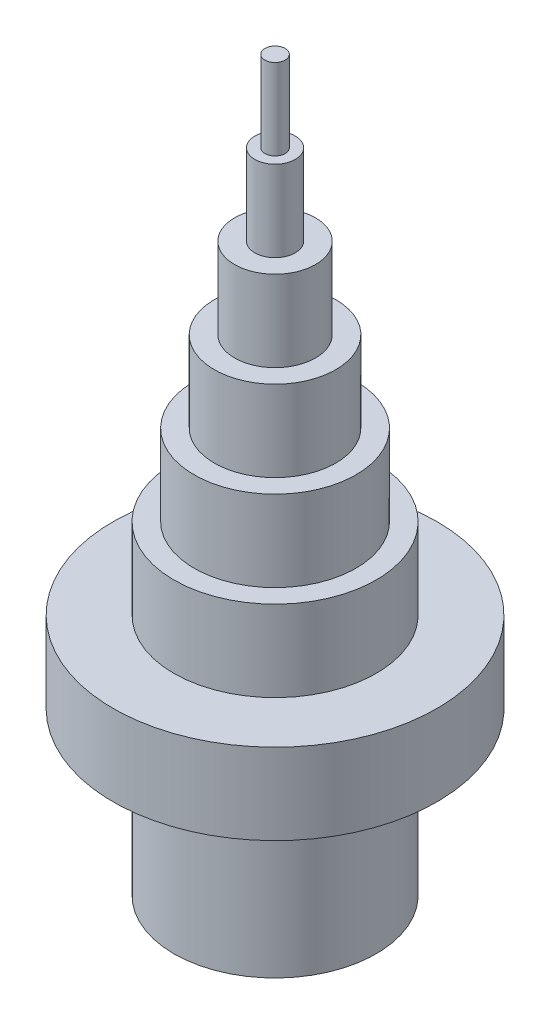
ISO-10303-21;
HEADER;
FILE_DESCRIPTION(('STEP AP214'),'2;1');
FILE_NAME('part.step','',(''),(''),'','','');
FILE_SCHEMA(('AUTOMOTIVE_DESIGN { 1 0 10303 214 1 1 1 1 }'));
ENDSEC;
DATA;
#1=APPLICATION_CONTEXT('core data for automotive mechanical design processes');
#2=APPLICATION_PROTOCOL_DEFINITION('international standard','automotive_design',2000,#1);
#3=PRODUCT_CONTEXT('',#1,'mechanical');
#4=PRODUCT('Part','Part','',(#3));
#5=PRODUCT_RELATED_PRODUCT_CATEGORY('part','',(#4));
#6=PRODUCT_DEFINITION_FORMATION('','',#4);
#7=PRODUCT_DEFINITION_CONTEXT('part definition',#1,'design');
#8=PRODUCT_DEFINITION('design','',#6,#7);
#9=PRODUCT_DEFINITION_SHAPE('','',#8);
#10=(LENGTH_UNIT() NAMED_UNIT(*) SI_UNIT(.MILLI.,.METRE.));
#11=(NAMED_UNIT(*) PLANE_ANGLE_UNIT() SI_UNIT($,.RADIAN.));
#12=(NAMED_UNIT(*) SI_UNIT($,.STERADIAN.) SOLID_ANGLE_UNIT());
#13=UNCERTAINTY_MEASURE_WITH_UNIT(LENGTH_MEASURE(1.E-05),#10,'distance_accuracy_value','');
#14=(GEOMETRIC_REPRESENTATION_CONTEXT(3) GLOBAL_UNCERTAINTY_ASSIGNED_CONTEXT((#13)) GLOBAL_UNIT_ASSIGNED_CONTEXT((#10,
#11,#12)) REPRESENTATION_CONTEXT('',''));
#15=CARTESIAN_POINT('',(0.,0.,0.));
#16=DIRECTION('',(0.,0.,1.));
#17=DIRECTION('',(1.,0.,0.));
#18=AXIS2_PLACEMENT_3D('',#15,#16,#17);
#19=CARTESIAN_POINT('',(0.,0.,0.));
#20=DIRECTION('',(0.,-1.,0.));
#21=DIRECTION('',(0.,0.,-1.));
#22=AXIS2_PLACEMENT_3D('',#19,#20,#21);
#23=PLANE('',#22);
#24=CARTESIAN_POINT('',(0.,0.,0.));
#25=DIRECTION('',(0.,-1.,0.));
#26=DIRECTION('',(0.,0.,-1.));
#27=AXIS2_PLACEMENT_3D('',#24,#25,#26);
#28=CIRCLE('',#27,20.);
#29=CARTESIAN_POINT('',(0.,0.,-20.));
#30=VERTEX_POINT('',#29);
#31=EDGE_CURVE('E87',#30,#30,#28,.T.);
#32=ORIENTED_EDGE('',*,*,#31,.F.);
#33=EDGE_LOOP('',(#32));
#34=FACE_BOUND('',#33,.T.);
#35=CARTESIAN_POINT('',(0.,0.,0.));
#36=DIRECTION('',(0.,-1.,0.));
#37=DIRECTION('',(0.,0.,-1.));
#38=AXIS2_PLACEMENT_3D('',#35,#36,#37);
#39=CIRCLE('',#38,25.);
#40=CARTESIAN_POINT('',(0.,0.,-25.));
#41=VERTEX_POINT('',#40);
#42=EDGE_CURVE('E10',#41,#41,#39,.T.);
#43=ORIENTED_EDGE('',*,*,#42,.T.);
#44=EDGE_LOOP('',(#43));
#45=FACE_BOUND('',#44,.T.);
#46=ADVANCED_FACE('F31',(#34,#45),#23,.T.);
#47=CARTESIAN_POINT('',(0.,0.,0.));
#48=DIRECTION('',(0.,-1.,0.));
#49=DIRECTION('',(0.,0.,-1.));
#50=AXIS2_PLACEMENT_3D('',#47,#48,#49);
#51=CYLINDRICAL_SURFACE('',#50,25.);
#52=CARTESIAN_POINT('',(0.,40.,0.));
#53=DIRECTION('',(0.,-1.,0.));
#54=DIRECTION('',(0.,0.,-1.));
#55=AXIS2_PLACEMENT_3D('',#52,#53,#54);
#56=CIRCLE('',#55,25.);
#57=CARTESIAN_POINT('',(0.,40.,-25.));
#58=VERTEX_POINT('',#57);
#59=EDGE_CURVE('E37',#58,#58,#56,.T.);
#60=ORIENTED_EDGE('',*,*,#59,.T.);
#61=EDGE_LOOP('',(#60));
#62=FACE_BOUND('',#61,.T.);
#63=ORIENTED_EDGE('',*,*,#42,.F.);
#64=EDGE_LOOP('',(#63));
#65=FACE_BOUND('',#64,.T.);
#66=ADVANCED_FACE('F103',(#62,#65),#51,.T.);
#67=CARTESIAN_POINT('',(25.,40.,0.));
#68=DIRECTION('',(0.,-1.,0.));
#69=DIRECTION('',(0.,0.,-1.));
#70=AXIS2_PLACEMENT_3D('',#67,#68,#69);
#71=PLANE('',#70);
#72=CARTESIAN_POINT('',(0.,40.,0.));
#73=DIRECTION('',(0.,-1.,0.));
#74=DIRECTION('',(0.,0.,-1.));
#75=AXIS2_PLACEMENT_3D('',#72,#73,#74);
#76=CIRCLE('',#75,40.);
#77=CARTESIAN_POINT('',(0.,40.,-40.));
#78=VERTEX_POINT('',#77);
#79=EDGE_CURVE('E41',#78,#78,#76,.T.);
#80=ORIENTED_EDGE('',*,*,#79,.T.);
#81=EDGE_LOOP('',(#80));
#82=FACE_BOUND('',#81,.T.);
#83=ORIENTED_EDGE('',*,*,#59,.F.);
#84=EDGE_LOOP('',(#83));
#85=FACE_BOUND('',#84,.T.);
#86=ADVANCED_FACE('F107',(#82,#85),#71,.T.);
#87=CARTESIAN_POINT('',(0.,0.,0.));
#88=DIRECTION('',(0.,-1.,0.));
#89=DIRECTION('',(0.,0.,-1.));
#90=AXIS2_PLACEMENT_3D('',#87,#88,#89);
#91=CYLINDRICAL_SURFACE('',#90,40.);
#92=CARTESIAN_POINT('',(0.,60.,0.));
#93=DIRECTION('',(0.,-1.,0.));
#94=DIRECTION('',(0.,0.,-1.));
#95=AXIS2_PLACEMENT_3D('',#92,#93,#94);
#96=CIRCLE('',#95,40.);
#97=CARTESIAN_POINT('',(0.,60.,-40.));
#98=VERTEX_POINT('',#97);
#99=EDGE_CURVE('E45',#98,#98,#96,.T.);
#100=ORIENTED_EDGE('',*,*,#99,.T.);
#101=EDGE_LOOP('',(#100));
#102=FACE_BOUND('',#101,.T.);
#103=ORIENTED_EDGE('',*,*,#79,.F.);
#104=EDGE_LOOP('',(#103));
#105=FACE_BOUND('',#104,.T.);
#106=ADVANCED_FACE('F111',(#102,#105),#91,.T.);
#107=CARTESIAN_POINT('',(40.,60.,0.));
#108=DIRECTION('',(0.,1.,0.));
#109=DIRECTION('',(0.,0.,1.));
#110=AXIS2_PLACEMENT_3D('',#107,#108,#109);
#111=PLANE('',#110);
#112=CARTESIAN_POINT('',(0.,60.,0.));
#113=DIRECTION('',(0.,-1.,0.));
#114=DIRECTION('',(0.,0.,-1.));
#115=AXIS2_PLACEMENT_3D('',#112,#113,#114);
#116=CIRCLE('',#115,25.);
#117=CARTESIAN_POINT('',(0.,60.,-25.));
#118=VERTEX_POINT('',#117);
#119=EDGE_CURVE('E50',#118,#118,#116,.T.);
#120=ORIENTED_EDGE('',*,*,#119,.T.);
#121=EDGE_LOOP('',(#120));
#122=FACE_BOUND('',#121,.T.);
#123=ORIENTED_EDGE('',*,*,#99,.F.);
#124=EDGE_LOOP('',(#123));
#125=FACE_BOUND('',#124,.T.);
#126=ADVANCED_FACE('F118',(#122,#125),#111,.T.);
#127=CARTESIAN_POINT('',(0.,0.,0.));
#128=DIRECTION('',(0.,-1.,0.));
#129=DIRECTION('',(0.,0.,-1.));
#130=AXIS2_PLACEMENT_3D('',#127,#128,#129);
#131=CYLINDRICAL_SURFACE('',#130,25.);
#132=CARTESIAN_POINT('',(0.,80.,0.));
#133=DIRECTION('',(0.,-1.,0.));
#134=DIRECTION('',(0.,0.,-1.));
#135=AXIS2_PLACEMENT_3D('',#132,#133,#134);
#136=CIRCLE('',#135,25.);
#137=CARTESIAN_POINT('',(0.,80.,-25.));
#138=VERTEX_POINT('',#137);
#139=EDGE_CURVE('E53',#138,#138,#136,.T.);
#140=ORIENTED_EDGE('',*,*,#139,.T.);
#141=EDGE_LOOP('',(#140));
#142=FACE_BOUND('',#141,.T.);
#143=ORIENTED_EDGE('',*,*,#119,.F.);
#144=EDGE_LOOP('',(#143));
#145=FACE_BOUND('',#144,.T.);
#146=ADVANCED_FACE('F122',(#142,#145),#131,.T.);
#147=CARTESIAN_POINT('',(25.,80.,0.));
#148=DIRECTION('',(0.,1.,0.));
#149=DIRECTION('',(0.,0.,1.));
#150=AXIS2_PLACEMENT_3D('',#147,#148,#149);
#151=PLANE('',#150);
#152=CARTESIAN_POINT('',(0.,80.,0.));
#153=DIRECTION('',(0.,-1.,0.));
#154=DIRECTION('',(0.,0.,-1.));
#155=AXIS2_PLACEMENT_3D('',#152,#153,#154);
#156=CIRCLE('',#155,20.);
#157=CARTESIAN_POINT('',(0.,80.,-20.));
#158=VERTEX_POINT('',#157);
#159=EDGE_CURVE('E56',#158,#158,#156,.T.);
#160=ORIENTED_EDGE('',*,*,#159,.T.);
#161=EDGE_LOOP('',(#160));
#162=FACE_BOUND('',#161,.T.);
#163=ORIENTED_EDGE('',*,*,#139,.F.);
#164=EDGE_LOOP('',(#163));
#165=FACE_BOUND('',#164,.T.);
#166=ADVANCED_FACE('F126',(#162,#165),#151,.T.);
#167=CARTESIAN_POINT('',(0.,0.,0.));
#168=DIRECTION('',(0.,-1.,0.));
#169=DIRECTION('',(0.,0.,-1.));
#170=AXIS2_PLACEMENT_3D('',#167,#168,#169);
#171=CYLINDRICAL_SURFACE('',#170,20.);
#172=CARTESIAN_POINT('',(0.,100.,0.));
#173=DIRECTION('',(0.,-1.,0.));
#174=DIRECTION('',(0.,0.,-1.));
#175=AXIS2_PLACEMENT_3D('',#172,#173,#174);
#176=CIRCLE('',#175,20.);
#177=CARTESIAN_POINT('',(0.,100.,-20.));
#178=VERTEX_POINT('',#177);
#179=EDGE_CURVE('E59',#178,#178,#176,.T.);
#180=ORIENTED_EDGE('',*,*,#179,.T.);
#181=EDGE_LOOP('',(#180));
#182=FACE_BOUND('',#181,.T.);
#183=ORIENTED_EDGE('',*,*,#159,.F.);
#184=EDGE_LOOP('',(#183));
#185=FACE_BOUND('',#184,.T.);
#186=ADVANCED_FACE('F130',(#182,#185),#171,.T.);
#187=CARTESIAN_POINT('',(20.,100.,0.));
#188=DIRECTION('',(0.,1.,0.));
#189=DIRECTION('',(0.,0.,1.));
#190=AXIS2_PLACEMENT_3D('',#187,#188,#189);
#191=PLANE('',#190);
#192=CARTESIAN_POINT('',(0.,100.,0.));
#193=DIRECTION('',(0.,-1.,0.));
#194=DIRECTION('',(0.,0.,-1.));
#195=AXIS2_PLACEMENT_3D('',#192,#193,#194);
#196=CIRCLE('',#195,15.);
#197=CARTESIAN_POINT('',(0.,100.,-15.));
#198=VERTEX_POINT('',#197);
#199=EDGE_CURVE('E62',#198,#198,#196,.T.);
#200=ORIENTED_EDGE('',*,*,#199,.T.);
#201=EDGE_LOOP('',(#200));
#202=FACE_BOUND('',#201,.T.);
#203=ORIENTED_EDGE('',*,*,#179,.F.);
#204=EDGE_LOOP('',(#203));
#205=FACE_BOUND('',#204,.T.);
#206=ADVANCED_FACE('F134',(#202,#205),#191,.T.);
#207=CARTESIAN_POINT('',(0.,0.,0.));
#208=DIRECTION('',(0.,-1.,0.));
#209=DIRECTION('',(0.,0.,-1.));
#210=AXIS2_PLACEMENT_3D('',#207,#208,#209);
#211=CYLINDRICAL_SURFACE('',#210,15.);
#212=CARTESIAN_POINT('',(0.,120.,0.));
#213=DIRECTION('',(0.,-1.,0.));
#214=DIRECTION('',(0.,0.,-1.));
#215=AXIS2_PLACEMENT_3D('',#212,#213,#214);
#216=CIRCLE('',#215,15.);
#217=CARTESIAN_POINT('',(0.,120.,-15.));
#218=VERTEX_POINT('',#217);
#219=EDGE_CURVE('E65',#218,#218,#216,.T.);
#220=ORIENTED_EDGE('',*,*,#219,.T.);
#221=EDGE_LOOP('',(#220));
#222=FACE_BOUND('',#221,.T.);
#223=ORIENTED_EDGE('',*,*,#199,.F.);
#224=EDGE_LOOP('',(#223));
#225=FACE_BOUND('',#224,.T.);
#226=ADVANCED_FACE('F138',(#222,#225),#211,.T.);
#227=CARTESIAN_POINT('',(15.,120.,0.));
#228=DIRECTION('',(0.,1.,0.));
#229=DIRECTION('',(0.,0.,1.));
#230=AXIS2_PLACEMENT_3D('',#227,#228,#229);
#231=PLANE('',#230);
#232=CARTESIAN_POINT('',(0.,120.,0.));
#233=DIRECTION('',(0.,-1.,0.));
#234=DIRECTION('',(0.,0.,-1.));
#235=AXIS2_PLACEMENT_3D('',#232,#233,#234);
#236=CIRCLE('',#235,10.);
#237=CARTESIAN_POINT('',(0.,120.,-10.));
#238=VERTEX_POINT('',#237);
#239=EDGE_CURVE('E68',#238,#238,#236,.T.);
#240=ORIENTED_EDGE('',*,*,#239,.T.);
#241=EDGE_LOOP('',(#240));
#242=FACE_BOUND('',#241,.T.);
#243=ORIENTED_EDGE('',*,*,#219,.F.);
#244=EDGE_LOOP('',(#243));
#245=FACE_BOUND('',#244,.T.);
#246=ADVANCED_FACE('F142',(#242,#245),#231,.T.);
#247=CARTESIAN_POINT('',(0.,0.,0.));
#248=DIRECTION('',(0.,-1.,0.));
#249=DIRECTION('',(0.,0.,-1.));
#250=AXIS2_PLACEMENT_3D('',#247,#248,#249);
#251=CYLINDRICAL_SURFACE('',#250,10.);
#252=CARTESIAN_POINT('',(0.,140.,0.));
#253=DIRECTION('',(0.,-1.,0.));
#254=DIRECTION('',(0.,0.,-1.));
#255=AXIS2_PLACEMENT_3D('',#252,#253,#254);
#256=CIRCLE('',#255,10.);
#257=CARTESIAN_POINT('',(0.,140.,-10.));
#258=VERTEX_POINT('',#257);
#259=EDGE_CURVE('E71',#258,#258,#256,.T.);
#260=ORIENTED_EDGE('',*,*,#259,.T.);
#261=EDGE_LOOP('',(#260));
#262=FACE_BOUND('',#261,.T.);
#263=ORIENTED_EDGE('',*,*,#239,.F.);
#264=EDGE_LOOP('',(#263));
#265=FACE_BOUND('',#264,.T.);
#266=ADVANCED_FACE('F146',(#262,#265),#251,.T.);
#267=CARTESIAN_POINT('',(10.,140.,0.));
#268=DIRECTION('',(0.,1.,0.));
#269=DIRECTION('',(0.,0.,1.));
#270=AXIS2_PLACEMENT_3D('',#267,#268,#269);
#271=PLANE('',#270);
#272=CARTESIAN_POINT('',(0.,140.,0.));
#273=DIRECTION('',(0.,-1.,0.));
#274=DIRECTION('',(0.,0.,-1.));
#275=AXIS2_PLACEMENT_3D('',#272,#273,#274);
#276=CIRCLE('',#275,5.);
#277=CARTESIAN_POINT('',(0.,140.,-5.));
#278=VERTEX_POINT('',#277);
#279=EDGE_CURVE('E74',#278,#278,#276,.T.);
#280=ORIENTED_EDGE('',*,*,#279,.T.);
#281=EDGE_LOOP('',(#280));
#282=FACE_BOUND('',#281,.T.);
#283=ORIENTED_EDGE('',*,*,#259,.F.);
#284=EDGE_LOOP('',(#283));
#285=FACE_BOUND('',#284,.T.);
#286=ADVANCED_FACE('F150',(#282,#285),#271,.T.);
#287=CARTESIAN_POINT('',(0.,0.,0.));
#288=DIRECTION('',(0.,-1.,0.));
#289=DIRECTION('',(0.,0.,-1.));
#290=AXIS2_PLACEMENT_3D('',#287,#288,#289);
#291=CYLINDRICAL_SURFACE('',#290,5.);
#292=CARTESIAN_POINT('',(0.,160.,0.));
#293=DIRECTION('',(0.,-1.,0.));
#294=DIRECTION('',(0.,0.,-1.));
#295=AXIS2_PLACEMENT_3D('',#292,#293,#294);
#296=CIRCLE('',#295,5.);
#297=CARTESIAN_POINT('',(0.,160.,-5.));
#298=VERTEX_POINT('',#297);
#299=EDGE_CURVE('E77',#298,#298,#296,.T.);
#300=ORIENTED_EDGE('',*,*,#299,.T.);
#301=EDGE_LOOP('',(#300));
#302=FACE_BOUND('',#301,.T.);
#303=ORIENTED_EDGE('',*,*,#279,.F.);
#304=EDGE_LOOP('',(#303));
#305=FACE_BOUND('',#304,.T.);
#306=ADVANCED_FACE('F154',(#302,#305),#291,.T.);
#307=CARTESIAN_POINT('',(5.,160.,0.));
#308=DIRECTION('',(0.,1.,0.));
#309=DIRECTION('',(0.,0.,1.));
#310=AXIS2_PLACEMENT_3D('',#307,#308,#309);
#311=PLANE('',#310);
#312=CARTESIAN_POINT('',(0.,160.,0.));
#313=DIRECTION('',(0.,-1.,0.));
#314=DIRECTION('',(0.,0.,-1.));
#315=AXIS2_PLACEMENT_3D('',#312,#313,#314);
#316=CIRCLE('',#315,2.5);
#317=CARTESIAN_POINT('',(0.,160.,-2.5));
#318=VERTEX_POINT('',#317);
#319=EDGE_CURVE('E80',#318,#318,#316,.T.);
#320=ORIENTED_EDGE('',*,*,#319,.T.);
#321=EDGE_LOOP('',(#320));
#322=FACE_BOUND('',#321,.T.);
#323=ORIENTED_EDGE('',*,*,#299,.F.);
#324=EDGE_LOOP('',(#323));
#325=FACE_BOUND('',#324,.T.);
#326=ADVANCED_FACE('F158',(#322,#325),#311,.T.);
#327=CARTESIAN_POINT('',(0.,0.,0.));
#328=DIRECTION('',(0.,-1.,0.));
#329=DIRECTION('',(0.,0.,-1.));
#330=AXIS2_PLACEMENT_3D('',#327,#328,#329);
#331=CYLINDRICAL_SURFACE('',#330,2.5);
#332=CARTESIAN_POINT('',(0.,180.,0.));
#333=DIRECTION('',(0.,-1.,0.));
#334=DIRECTION('',(0.,0.,-1.));
#335=AXIS2_PLACEMENT_3D('',#332,#333,#334);
#336=CIRCLE('',#335,2.5);
#337=CARTESIAN_POINT('',(0.,180.,-2.5));
#338=VERTEX_POINT('',#337);
#339=EDGE_CURVE('E83',#338,#338,#336,.T.);
#340=ORIENTED_EDGE('',*,*,#339,.T.);
#341=EDGE_LOOP('',(#340));
#342=FACE_BOUND('',#341,.T.);
#343=ORIENTED_EDGE('',*,*,#319,.F.);
#344=EDGE_LOOP('',(#343));
#345=FACE_BOUND('',#344,.T.);
#346=ADVANCED_FACE('F162',(#342,#345),#331,.T.);
#347=CARTESIAN_POINT('',(2.5,180.,0.));
#348=DIRECTION('',(0.,1.,0.));
#349=DIRECTION('',(0.,0.,1.));
#350=AXIS2_PLACEMENT_3D('',#347,#348,#349);
#351=PLANE('',#350);
#352=ORIENTED_EDGE('',*,*,#339,.F.);
#353=EDGE_LOOP('',(#352));
#354=FACE_BOUND('',#353,.T.);
#355=ADVANCED_FACE('F98',(#354),#351,.T.);
#356=CARTESIAN_POINT('',(0.,40.,0.));
#357=DIRECTION('',(0.,-1.,0.));
#358=DIRECTION('',(0.,0.,-1.));
#359=AXIS2_PLACEMENT_3D('',#356,#357,#358);
#360=CYLINDRICAL_SURFACE('',#359,20.);
#361=CARTESIAN_POINT('',(0.,40.,0.));
#362=DIRECTION('',(0.,-1.,0.));
#363=DIRECTION('',(0.,0.,-1.));
#364=AXIS2_PLACEMENT_3D('',#361,#362,#363);
#365=CIRCLE('',#364,20.);
#366=CARTESIAN_POINT('',(0.,40.,-20.));
#367=VERTEX_POINT('',#366);
#368=EDGE_CURVE('E86',#367,#367,#365,.T.);
#369=ORIENTED_EDGE('',*,*,#368,.F.);
#370=EDGE_LOOP('',(#369));
#371=FACE_BOUND('',#370,.T.);
#372=ORIENTED_EDGE('',*,*,#31,.T.);
#373=EDGE_LOOP('',(#372));
#374=FACE_BOUND('',#373,.T.);
#375=ADVANCED_FACE('F95',(#371,#374),#360,.F.);
#376=CARTESIAN_POINT('',(0.,40.,0.));
#377=DIRECTION('',(0.,-1.,0.));
#378=DIRECTION('',(0.,0.,-1.));
#379=AXIS2_PLACEMENT_3D('',#376,#377,#378);
#380=PLANE('',#379);
#381=ORIENTED_EDGE('',*,*,#368,.T.);
#382=EDGE_LOOP('',(#381));
#383=FACE_BOUND('',#382,.T.);
#384=ADVANCED_FACE('F93',(#383),#380,.T.);
#385=CLOSED_SHELL('',(#46,#66,#86,#106,#126,#146,#166,#186,#206,#226,#246,#266,#286,#306,#326,
#346,#355,#375,#384));
#386=MANIFOLD_SOLID_BREP('B2',#385);
#387=ADVANCED_BREP_SHAPE_REPRESENTATION('',(#18,#386),#14);
#388=SHAPE_DEFINITION_REPRESENTATION(#9,#387);
ENDSEC;
END-ISO-10303-21;
